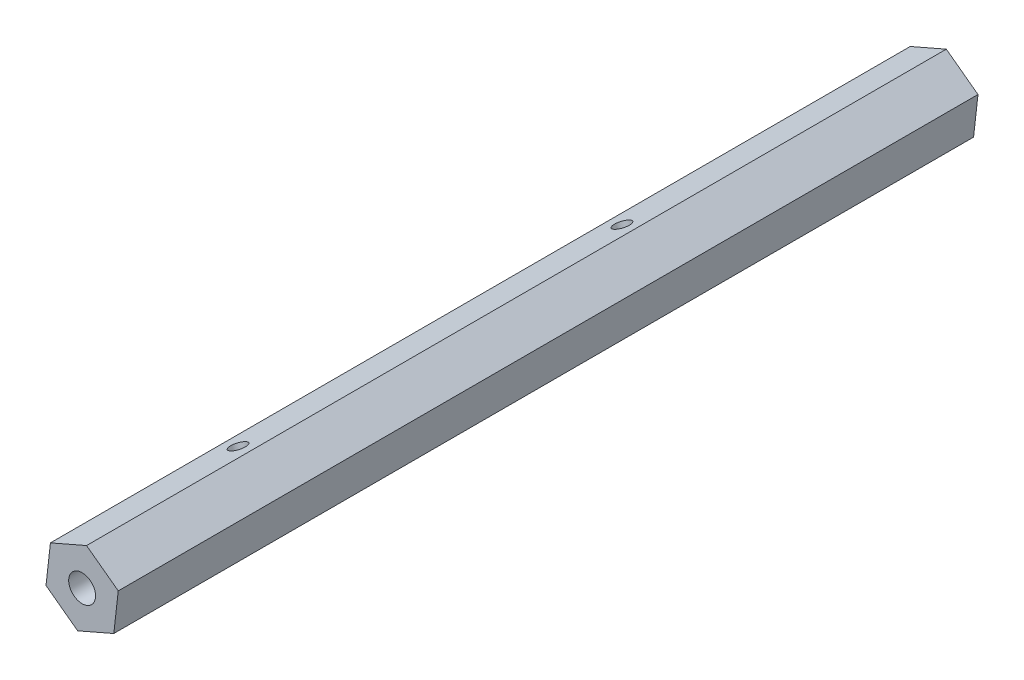
ISO-10303-21;
HEADER;
FILE_DESCRIPTION(('STEP AP214'),'2;1');
FILE_NAME('part.step','',(''),(''),'','','');
FILE_SCHEMA(('AUTOMOTIVE_DESIGN { 1 0 10303 214 1 1 1 1 }'));
ENDSEC;
DATA;
#1=APPLICATION_CONTEXT('core data for automotive mechanical design processes');
#2=APPLICATION_PROTOCOL_DEFINITION('international standard','automotive_design',2000,#1);
#3=PRODUCT_CONTEXT('',#1,'mechanical');
#4=PRODUCT('Part','Part','',(#3));
#5=PRODUCT_RELATED_PRODUCT_CATEGORY('part','',(#4));
#6=PRODUCT_DEFINITION_FORMATION('','',#4);
#7=PRODUCT_DEFINITION_CONTEXT('part definition',#1,'design');
#8=PRODUCT_DEFINITION('design','',#6,#7);
#9=PRODUCT_DEFINITION_SHAPE('','',#8);
#10=(LENGTH_UNIT() NAMED_UNIT(*) SI_UNIT(.MILLI.,.METRE.));
#11=(NAMED_UNIT(*) PLANE_ANGLE_UNIT() SI_UNIT($,.RADIAN.));
#12=(NAMED_UNIT(*) SI_UNIT($,.STERADIAN.) SOLID_ANGLE_UNIT());
#13=UNCERTAINTY_MEASURE_WITH_UNIT(LENGTH_MEASURE(1.E-05),#10,'distance_accuracy_value','');
#14=(GEOMETRIC_REPRESENTATION_CONTEXT(3) GLOBAL_UNCERTAINTY_ASSIGNED_CONTEXT((#13)) GLOBAL_UNIT_ASSIGNED_CONTEXT((#10,
#11,#12)) REPRESENTATION_CONTEXT('',''));
#15=CARTESIAN_POINT('',(0.,0.,0.));
#16=DIRECTION('',(0.,0.,1.));
#17=DIRECTION('',(1.,0.,0.));
#18=AXIS2_PLACEMENT_3D('',#15,#16,#17);
#19=CARTESIAN_POINT('',(0.,0.,160.));
#20=DIRECTION('',(0.,0.,1.));
#21=DIRECTION('',(1.,0.,0.));
#22=AXIS2_PLACEMENT_3D('',#19,#20,#21);
#23=PLANE('',#22);
#24=DIRECTION('',(0.916780772261359,0.399390805617589,0.));
#25=VECTOR('',#24,1.);
#26=CARTESIAN_POINT('',(-0.82494640722466,-7.285794174868,160.));
#27=LINE('',#26,#25);
#28=CARTESIAN_POINT('',(-0.82494640722466,-7.285794174868,160.));
#29=VERTEX_POINT('',#28);
#30=CARTESIAN_POINT('',(5.89720963856804,-4.35732163285126,160.));
#31=VERTEX_POINT('',#30);
#32=EDGE_CURVE('E135',#29,#31,#27,.T.);
#33=ORIENTED_EDGE('',*,*,#32,.T.);
#34=DIRECTION('',(0.112507802427915,0.993650841288247,0.));
#35=VECTOR('',#34,1.);
#36=CARTESIAN_POINT('',(5.89720963856804,-4.35732163285126,160.));
#37=LINE('',#36,#35);
#38=CARTESIAN_POINT('',(6.7221560457927,2.92847254201674,160.));
#39=VERTEX_POINT('',#38);
#40=EDGE_CURVE('E93',#31,#39,#37,.T.);
#41=ORIENTED_EDGE('',*,*,#40,.T.);
#42=DIRECTION('',(-0.804272969833444,0.594260035670658,0.));
#43=VECTOR('',#42,1.);
#44=CARTESIAN_POINT('',(6.7221560457927,2.92847254201674,160.));
#45=LINE('',#44,#43);
#46=CARTESIAN_POINT('',(0.824946407224662,7.285794174868,160.));
#47=VERTEX_POINT('',#46);
#48=EDGE_CURVE('E106',#39,#47,#45,.T.);
#49=ORIENTED_EDGE('',*,*,#48,.T.);
#50=DIRECTION('',(-0.916780772261359,-0.399390805617589,0.));
#51=VECTOR('',#50,1.);
#52=CARTESIAN_POINT('',(0.824946407224662,7.285794174868,160.));
#53=LINE('',#52,#51);
#54=CARTESIAN_POINT('',(-5.89720963856804,4.35732163285126,160.));
#55=VERTEX_POINT('',#54);
#56=EDGE_CURVE('E100',#47,#55,#53,.T.);
#57=ORIENTED_EDGE('',*,*,#56,.T.);
#58=DIRECTION('',(-0.112507802427915,-0.993650841288247,0.));
#59=VECTOR('',#58,1.);
#60=CARTESIAN_POINT('',(-5.89720963856804,4.35732163285126,160.));
#61=LINE('',#60,#59);
#62=CARTESIAN_POINT('',(-6.7221560457927,-2.92847254201674,160.));
#63=VERTEX_POINT('',#62);
#64=EDGE_CURVE('E104',#55,#63,#61,.T.);
#65=ORIENTED_EDGE('',*,*,#64,.T.);
#66=DIRECTION('',(0.804272969833444,-0.594260035670658,0.));
#67=VECTOR('',#66,1.);
#68=CARTESIAN_POINT('',(-6.7221560457927,-2.92847254201674,160.));
#69=LINE('',#68,#67);
#70=EDGE_CURVE('E56',#63,#29,#69,.T.);
#71=ORIENTED_EDGE('',*,*,#70,.T.);
#72=EDGE_LOOP('',(#33,#41,#49,#57,#65,#71));
#73=FACE_BOUND('',#72,.T.);
#74=CARTESIAN_POINT('',(0.,0.,160.));
#75=DIRECTION('',(0.,0.,1.));
#76=DIRECTION('',(1.,0.,0.));
#77=AXIS2_PLACEMENT_3D('',#74,#75,#76);
#78=CIRCLE('',#77,2.5);
#79=CARTESIAN_POINT('',(2.5,0.,160.));
#80=VERTEX_POINT('',#79);
#81=EDGE_CURVE('E128',#80,#80,#78,.T.);
#82=ORIENTED_EDGE('',*,*,#81,.F.);
#83=EDGE_LOOP('',(#82));
#84=FACE_BOUND('',#83,.T.);
#85=ADVANCED_FACE('F32',(#73,#84),#23,.T.);
#86=CARTESIAN_POINT('',(0.,0.,0.));
#87=DIRECTION('',(0.,0.,1.));
#88=DIRECTION('',(1.,0.,0.));
#89=AXIS2_PLACEMENT_3D('',#86,#87,#88);
#90=PLANE('',#89);
#91=DIRECTION('',(0.916780772261359,0.399390805617589,0.));
#92=VECTOR('',#91,1.);
#93=CARTESIAN_POINT('',(-0.82494640722466,-7.285794174868,0.));
#94=LINE('',#93,#92);
#95=CARTESIAN_POINT('',(-0.82494640722466,-7.285794174868,0.));
#96=VERTEX_POINT('',#95);
#97=CARTESIAN_POINT('',(5.89720963856804,-4.35732163285126,0.));
#98=VERTEX_POINT('',#97);
#99=EDGE_CURVE('E124',#96,#98,#94,.T.);
#100=ORIENTED_EDGE('',*,*,#99,.F.);
#101=DIRECTION('',(0.804272969833444,-0.594260035670658,0.));
#102=VECTOR('',#101,1.);
#103=CARTESIAN_POINT('',(-6.7221560457927,-2.92847254201674,0.));
#104=LINE('',#103,#102);
#105=CARTESIAN_POINT('',(-6.7221560457927,-2.92847254201674,0.));
#106=VERTEX_POINT('',#105);
#107=EDGE_CURVE('E85',#106,#96,#104,.T.);
#108=ORIENTED_EDGE('',*,*,#107,.F.);
#109=DIRECTION('',(-0.112507802427915,-0.993650841288247,0.));
#110=VECTOR('',#109,1.);
#111=CARTESIAN_POINT('',(-5.89720963856804,4.35732163285126,0.));
#112=LINE('',#111,#110);
#113=CARTESIAN_POINT('',(-5.89720963856804,4.35732163285126,0.));
#114=VERTEX_POINT('',#113);
#115=EDGE_CURVE('E79',#114,#106,#112,.T.);
#116=ORIENTED_EDGE('',*,*,#115,.F.);
#117=DIRECTION('',(-0.916780772261359,-0.399390805617589,0.));
#118=VECTOR('',#117,1.);
#119=CARTESIAN_POINT('',(0.824946407224662,7.285794174868,0.));
#120=LINE('',#119,#118);
#121=CARTESIAN_POINT('',(0.824946407224662,7.285794174868,0.));
#122=VERTEX_POINT('',#121);
#123=EDGE_CURVE('E114',#122,#114,#120,.T.);
#124=ORIENTED_EDGE('',*,*,#123,.F.);
#125=DIRECTION('',(-0.804272969833444,0.594260035670658,0.));
#126=VECTOR('',#125,1.);
#127=CARTESIAN_POINT('',(6.7221560457927,2.92847254201674,0.));
#128=LINE('',#127,#126);
#129=CARTESIAN_POINT('',(6.7221560457927,2.92847254201674,0.));
#130=VERTEX_POINT('',#129);
#131=EDGE_CURVE('E130',#130,#122,#128,.T.);
#132=ORIENTED_EDGE('',*,*,#131,.F.);
#133=DIRECTION('',(0.112507802427915,0.993650841288247,0.));
#134=VECTOR('',#133,1.);
#135=CARTESIAN_POINT('',(5.89720963856804,-4.35732163285126,0.));
#136=LINE('',#135,#134);
#137=EDGE_CURVE('E127',#98,#130,#136,.T.);
#138=ORIENTED_EDGE('',*,*,#137,.F.);
#139=EDGE_LOOP('',(#100,#108,#116,#124,#132,#138));
#140=FACE_BOUND('',#139,.T.);
#141=CARTESIAN_POINT('',(0.,0.,0.));
#142=DIRECTION('',(0.,0.,1.));
#143=DIRECTION('',(1.,0.,0.));
#144=AXIS2_PLACEMENT_3D('',#141,#142,#143);
#145=CIRCLE('',#144,2.5);
#146=CARTESIAN_POINT('',(2.5,0.,0.));
#147=VERTEX_POINT('',#146);
#148=EDGE_CURVE('E189',#147,#147,#145,.T.);
#149=ORIENTED_EDGE('',*,*,#148,.T.);
#150=EDGE_LOOP('',(#149));
#151=FACE_BOUND('',#150,.T.);
#152=ADVANCED_FACE('F203',(#140,#151),#90,.F.);
#153=CARTESIAN_POINT('',(-0.82494640722466,-7.285794174868,160.));
#154=DIRECTION('',(-0.399390805617589,0.916780772261359,0.));
#155=DIRECTION('',(-0.916780772261359,-0.399390805617589,0.));
#156=AXIS2_PLACEMENT_3D('',#153,#154,#155);
#157=PLANE('',#156);
#158=CARTESIAN_POINT('',(2.53613161567169,-5.82155790385963,128.44));
#159=DIRECTION('',(-0.399390805617589,0.916780772261359,0.));
#160=DIRECTION('',(-0.916780772261359,-0.399390805617589,0.));
#161=AXIS2_PLACEMENT_3D('',#158,#159,#160);
#162=CIRCLE('',#161,1.5);
#163=CARTESIAN_POINT('',(1.16096045727965,-6.42064411228601,128.44));
#164=VERTEX_POINT('',#163);
#165=EDGE_CURVE('E176',#164,#164,#162,.T.);
#166=ORIENTED_EDGE('',*,*,#165,.T.);
#167=EDGE_LOOP('',(#166));
#168=FACE_BOUND('',#167,.T.);
#169=CARTESIAN_POINT('',(2.53613161567169,-5.82155790385963,57.));
#170=DIRECTION('',(-0.399390805617589,0.916780772261359,0.));
#171=DIRECTION('',(-0.916780772261359,-0.399390805617589,0.));
#172=AXIS2_PLACEMENT_3D('',#169,#170,#171);
#173=CIRCLE('',#172,1.5);
#174=CARTESIAN_POINT('',(1.16096045727965,-6.42064411228601,57.));
#175=VERTEX_POINT('',#174);
#176=EDGE_CURVE('E186',#175,#175,#173,.T.);
#177=ORIENTED_EDGE('',*,*,#176,.T.);
#178=EDGE_LOOP('',(#177));
#179=FACE_BOUND('',#178,.T.);
#180=ORIENTED_EDGE('',*,*,#99,.T.);
#181=DIRECTION('',(0.,0.,-1.));
#182=VECTOR('',#181,1.);
#183=CARTESIAN_POINT('',(5.89720963856804,-4.35732163285126,160.));
#184=LINE('',#183,#182);
#185=EDGE_CURVE('E11',#31,#98,#184,.T.);
#186=ORIENTED_EDGE('',*,*,#185,.F.);
#187=ORIENTED_EDGE('',*,*,#32,.F.);
#188=DIRECTION('',(0.,0.,-1.));
#189=VECTOR('',#188,1.);
#190=CARTESIAN_POINT('',(-0.82494640722466,-7.285794174868,160.));
#191=LINE('',#190,#189);
#192=EDGE_CURVE('E120',#29,#96,#191,.T.);
#193=ORIENTED_EDGE('',*,*,#192,.T.);
#194=EDGE_LOOP('',(#180,#186,#187,#193));
#195=FACE_BOUND('',#194,.T.);
#196=ADVANCED_FACE('F34',(#168,#179,#195),#157,.F.);
#197=CARTESIAN_POINT('',(5.89720963856804,-4.35732163285126,160.));
#198=DIRECTION('',(-0.993650841288247,0.112507802427915,0.));
#199=DIRECTION('',(-0.112507802427915,-0.993650841288247,0.));
#200=AXIS2_PLACEMENT_3D('',#197,#198,#199);
#201=PLANE('',#200);
#202=ORIENTED_EDGE('',*,*,#137,.T.);
#203=DIRECTION('',(0.,0.,-1.));
#204=VECTOR('',#203,1.);
#205=CARTESIAN_POINT('',(6.7221560457927,2.92847254201674,160.));
#206=LINE('',#205,#204);
#207=EDGE_CURVE('E47',#39,#130,#206,.T.);
#208=ORIENTED_EDGE('',*,*,#207,.F.);
#209=ORIENTED_EDGE('',*,*,#40,.F.);
#210=ORIENTED_EDGE('',*,*,#185,.T.);
#211=EDGE_LOOP('',(#202,#208,#209,#210));
#212=FACE_BOUND('',#211,.T.);
#213=ADVANCED_FACE('F197',(#212),#201,.F.);
#214=CARTESIAN_POINT('',(6.7221560457927,2.92847254201674,160.));
#215=DIRECTION('',(-0.594260035670658,-0.804272969833444,0.));
#216=DIRECTION('',(0.804272969833444,-0.594260035670658,0.));
#217=AXIS2_PLACEMENT_3D('',#214,#215,#216);
#218=PLANE('',#217);
#219=ORIENTED_EDGE('',*,*,#131,.T.);
#220=DIRECTION('',(0.,0.,-1.));
#221=VECTOR('',#220,1.);
#222=CARTESIAN_POINT('',(0.824946407224662,7.285794174868,160.));
#223=LINE('',#222,#221);
#224=EDGE_CURVE('E115',#47,#122,#223,.T.);
#225=ORIENTED_EDGE('',*,*,#224,.F.);
#226=ORIENTED_EDGE('',*,*,#48,.F.);
#227=ORIENTED_EDGE('',*,*,#207,.T.);
#228=EDGE_LOOP('',(#219,#225,#226,#227));
#229=FACE_BOUND('',#228,.T.);
#230=ADVANCED_FACE('F200',(#229),#218,.F.);
#231=CARTESIAN_POINT('',(0.824946407224662,7.285794174868,160.));
#232=DIRECTION('',(0.399390805617589,-0.916780772261359,0.));
#233=DIRECTION('',(0.916780772261359,0.399390805617589,0.));
#234=AXIS2_PLACEMENT_3D('',#231,#232,#233);
#235=PLANE('',#234);
#236=CARTESIAN_POINT('',(-2.53613161567169,5.82155790385963,128.44));
#237=DIRECTION('',(-0.399390805617589,0.916780772261359,0.));
#238=DIRECTION('',(-0.916780772261359,-0.399390805617589,0.));
#239=AXIS2_PLACEMENT_3D('',#236,#237,#238);
#240=CIRCLE('',#239,1.5);
#241=CARTESIAN_POINT('',(-3.91130277406373,5.22247169543325,128.44));
#242=VERTEX_POINT('',#241);
#243=EDGE_CURVE('E173',#242,#242,#240,.T.);
#244=ORIENTED_EDGE('',*,*,#243,.F.);
#245=EDGE_LOOP('',(#244));
#246=FACE_BOUND('',#245,.T.);
#247=CARTESIAN_POINT('',(-2.53613161567169,5.82155790385963,57.));
#248=DIRECTION('',(-0.399390805617589,0.916780772261359,0.));
#249=DIRECTION('',(-0.916780772261359,-0.399390805617589,0.));
#250=AXIS2_PLACEMENT_3D('',#247,#248,#249);
#251=CIRCLE('',#250,1.5);
#252=CARTESIAN_POINT('',(-3.91130277406373,5.22247169543325,57.));
#253=VERTEX_POINT('',#252);
#254=EDGE_CURVE('E149',#253,#253,#251,.T.);
#255=ORIENTED_EDGE('',*,*,#254,.F.);
#256=EDGE_LOOP('',(#255));
#257=FACE_BOUND('',#256,.T.);
#258=ORIENTED_EDGE('',*,*,#123,.T.);
#259=DIRECTION('',(0.,0.,-1.));
#260=VECTOR('',#259,1.);
#261=CARTESIAN_POINT('',(-5.89720963856804,4.35732163285126,160.));
#262=LINE('',#261,#260);
#263=EDGE_CURVE('E111',#55,#114,#262,.T.);
#264=ORIENTED_EDGE('',*,*,#263,.F.);
#265=ORIENTED_EDGE('',*,*,#56,.F.);
#266=ORIENTED_EDGE('',*,*,#224,.T.);
#267=EDGE_LOOP('',(#258,#264,#265,#266));
#268=FACE_BOUND('',#267,.T.);
#269=ADVANCED_FACE('F112',(#246,#257,#268),#235,.F.);
#270=CARTESIAN_POINT('',(-5.89720963856804,4.35732163285126,160.));
#271=DIRECTION('',(0.993650841288247,-0.112507802427915,0.));
#272=DIRECTION('',(0.112507802427915,0.993650841288247,0.));
#273=AXIS2_PLACEMENT_3D('',#270,#271,#272);
#274=PLANE('',#273);
#275=ORIENTED_EDGE('',*,*,#115,.T.);
#276=DIRECTION('',(0.,0.,-1.));
#277=VECTOR('',#276,1.);
#278=CARTESIAN_POINT('',(-6.7221560457927,-2.92847254201674,160.));
#279=LINE('',#278,#277);
#280=EDGE_CURVE('E116',#63,#106,#279,.T.);
#281=ORIENTED_EDGE('',*,*,#280,.F.);
#282=ORIENTED_EDGE('',*,*,#64,.F.);
#283=ORIENTED_EDGE('',*,*,#263,.T.);
#284=EDGE_LOOP('',(#275,#281,#282,#283));
#285=FACE_BOUND('',#284,.T.);
#286=ADVANCED_FACE('F118',(#285),#274,.F.);
#287=CARTESIAN_POINT('',(-6.7221560457927,-2.92847254201674,160.));
#288=DIRECTION('',(0.594260035670658,0.804272969833444,0.));
#289=DIRECTION('',(-0.804272969833444,0.594260035670658,0.));
#290=AXIS2_PLACEMENT_3D('',#287,#288,#289);
#291=PLANE('',#290);
#292=ORIENTED_EDGE('',*,*,#107,.T.);
#293=ORIENTED_EDGE('',*,*,#192,.F.);
#294=ORIENTED_EDGE('',*,*,#70,.F.);
#295=ORIENTED_EDGE('',*,*,#280,.T.);
#296=EDGE_LOOP('',(#292,#293,#294,#295));
#297=FACE_BOUND('',#296,.T.);
#298=ADVANCED_FACE('F206',(#297),#291,.F.);
#299=CARTESIAN_POINT('',(0.,0.,160.));
#300=DIRECTION('',(0.,0.,-1.));
#301=DIRECTION('',(-1.,0.,0.));
#302=AXIS2_PLACEMENT_3D('',#299,#300,#301);
#303=CYLINDRICAL_SURFACE('',#302,2.5);
#304=CARTESIAN_POINT('',(-0.57638954715686,-2.4326477529491,128.44));
#305=CARTESIAN_POINT('',(-0.576395581822902,-2.43264401881237,128.51547897529));
#306=CARTESIAN_POINT('',(-0.569403150110111,-2.43433412807468,128.59093843408));
#307=CARTESIAN_POINT('',(-0.542132556356859,-2.44054929190407,128.739323903962));
#308=CARTESIAN_POINT('',(-0.521840529149695,-2.44507730484223,128.812247187385));
#309=CARTESIAN_POINT('',(-0.469784135663803,-2.45560435261248,128.953083641677));
#310=CARTESIAN_POINT('',(-0.438102630090655,-2.46159266477605,129.021028838035));
#311=CARTESIAN_POINT('',(-0.365018247693141,-2.47348553828873,129.151437453368));
#312=CARTESIAN_POINT('',(-0.32361247136544,-2.47939007410017,129.213899229695));
#313=CARTESIAN_POINT('',(-0.227045236393262,-2.4901980875089,129.339949016664));
#314=CARTESIAN_POINT('',(-0.17082089148849,-2.49489089763814,129.402740957124));
#315=CARTESIAN_POINT('',(-0.0498441671983197,-2.50023742399107,129.519764762742));
#316=CARTESIAN_POINT('',(0.0149145969306781,-2.50088809850584,129.573990151671));
#317=CARTESIAN_POINT('',(0.158683603954994,-2.49610264024284,129.67813380971));
#318=CARTESIAN_POINT('',(0.238477659694683,-2.49000155786441,129.72695446367));
#319=CARTESIAN_POINT('',(0.403878235161059,-2.46856466081536,129.810809722444));
#320=CARTESIAN_POINT('',(0.489479337698846,-2.45323735065145,129.845856974123));
#321=CARTESIAN_POINT('',(0.654877740645855,-2.41405338827928,129.897595922813));
#322=CARTESIAN_POINT('',(0.734449120080628,-2.39115051271235,129.915720360967));
#323=CARTESIAN_POINT('',(0.892574780637896,-2.3367235623609,129.937942802863));
#324=CARTESIAN_POINT('',(0.971129947682382,-2.30520761332716,129.942053978));
#325=CARTESIAN_POINT('',(1.11462723212544,-2.23898877574663,129.936386252658));
#326=CARTESIAN_POINT('',(1.18004951906869,-2.20516562761356,129.928266473831));
#327=CARTESIAN_POINT('',(1.30603796647122,-2.13296404015878,129.901520204352));
#328=CARTESIAN_POINT('',(1.36660376714713,-2.09458526386363,129.882892936093));
#329=CARTESIAN_POINT('',(1.48200249872774,-2.01460475176339,129.835834437296));
#330=CARTESIAN_POINT('',(1.53680012038517,-1.97298560471853,129.807346938861));
#331=CARTESIAN_POINT('',(1.6396433562824,-1.88838809427253,129.741615383774));
#332=CARTESIAN_POINT('',(1.68768721175921,-1.84540938037997,129.704369052941));
#333=CARTESIAN_POINT('',(1.78216268910409,-1.75461780644997,129.617160907196));
#334=CARTESIAN_POINT('',(1.82771628931296,-1.70684071441925,129.566211688264));
#335=CARTESIAN_POINT('',(1.91027078457971,-1.61392014276796,129.45559588214));
#336=CARTESIAN_POINT('',(1.94725992624249,-1.56878034516075,129.395917496525));
#337=CARTESIAN_POINT('',(2.01666568334709,-1.47873195023732,129.261346593836));
#338=CARTESIAN_POINT('',(2.04805562829731,-1.43445637856488,129.185492423461));
#339=CARTESIAN_POINT('',(2.10053394215099,-1.35645826114183,129.025293768363));
#340=CARTESIAN_POINT('',(2.12164130048488,-1.32271630410056,128.940965283874));
#341=CARTESIAN_POINT('',(2.14955783626513,-1.27669018748368,128.787606368105));
#342=CARTESIAN_POINT('',(2.15861344505284,-1.26116140120893,128.719959367703));
#343=CARTESIAN_POINT('',(2.17075972501381,-1.24014384550811,128.5826263897));
#344=CARTESIAN_POINT('',(2.17385733357879,-1.23464339964663,128.512942879515));
#345=CARTESIAN_POINT('',(2.17404400485859,-1.23431467031473,128.373448317564));
#346=CARTESIAN_POINT('',(2.17112474319764,-1.2395011722976,128.303637222785));
#347=CARTESIAN_POINT('',(2.15931482032539,-1.25995740439183,128.166012656251));
#348=CARTESIAN_POINT('',(2.15041943908395,-1.27523510452439,128.09820080776));
#349=CARTESIAN_POINT('',(2.12678104734754,-1.31427373251579,127.96628542052));
#350=CARTESIAN_POINT('',(2.11204534183344,-1.3380240592597,127.902177363468));
#351=CARTESIAN_POINT('',(2.07678957077972,-1.39211551225696,127.77852228427));
#352=CARTESIAN_POINT('',(2.05626732301365,-1.4224591239842,127.718976993634));
#353=CARTESIAN_POINT('',(2.00516831188243,-1.49383848978168,127.594759917488));
#354=CARTESIAN_POINT('',(1.97344591750725,-1.5358156297985,127.531099164903));
#355=CARTESIAN_POINT('',(1.90167680787897,-1.62384002888832,127.411714515151));
#356=CARTESIAN_POINT('',(1.8616221184163,-1.66989116242972,127.355998307831));
#357=CARTESIAN_POINT('',(1.76719689263714,-1.76983867634096,127.24677599265));
#358=CARTESIAN_POINT('',(1.71164211027909,-1.82397655797327,127.194499273394));
#359=CARTESIAN_POINT('',(1.58969134541333,-1.93117955543457,127.103097223163));
#360=CARTESIAN_POINT('',(1.5233025947636,-1.98424536051844,127.063963172159));
#361=CARTESIAN_POINT('',(1.38582925299775,-2.08232480096161,127.003131796569));
#362=CARTESIAN_POINT('',(1.315436792296,-2.12764335758025,126.980373772209));
#363=CARTESIAN_POINT('',(1.16803256667809,-2.21198565963132,126.949285397154));
#364=CARTESIAN_POINT('',(1.09102840114908,-2.25101648745361,126.940938709282));
#365=CARTESIAN_POINT('',(0.943804655735426,-2.3162125200141,126.939325391414));
#366=CARTESIAN_POINT('',(0.874049221117041,-2.34339922290543,126.944196665437));
#367=CARTESIAN_POINT('',(0.733869312328283,-2.39100654657625,126.964893824382));
#368=CARTESIAN_POINT('',(0.663444830714412,-2.4114270919878,126.980719831322));
#369=CARTESIAN_POINT('',(0.525164416216587,-2.4452393678214,127.022219571584));
#370=CARTESIAN_POINT('',(0.457285412375869,-2.45873838931308,127.047731596129));
#371=CARTESIAN_POINT('',(0.324620244057245,-2.47974554273226,127.107640594555));
#372=CARTESIAN_POINT('',(0.259834777004811,-2.48725232967385,127.14203956086));
#373=CARTESIAN_POINT('',(0.127938862068149,-2.49769278619842,127.222925196569));
#374=CARTESIAN_POINT('',(0.0613395369166302,-2.50004152429229,127.270318709017));
#375=CARTESIAN_POINT('',(-0.0648329177952999,-2.49995725709006,127.373753033718));
#376=CARTESIAN_POINT('',(-0.124398133021654,-2.49751891901282,127.429803425608));
#377=CARTESIAN_POINT('',(-0.241941281463492,-2.48904738081413,127.557285562178));
#378=CARTESIAN_POINT('',(-0.298760022661342,-2.48259751699635,127.629766486166));
#379=CARTESIAN_POINT('',(-0.398867456247678,-2.46849487686646,127.783484852767));
#380=CARTESIAN_POINT('',(-0.442163181724813,-2.46084272896472,127.864717713981));
#381=CARTESIAN_POINT('',(-0.509094944125183,-2.44783479131457,128.027064285137));
#382=CARTESIAN_POINT('',(-0.53409459289075,-2.44233866566487,128.107595235961));
#383=CARTESIAN_POINT('',(-0.567720849517202,-2.43475090031513,128.272097394704));
#384=CARTESIAN_POINT('',(-0.576382836079444,-2.43265190563634,128.356060765759));
#385=CARTESIAN_POINT('',(-0.57638954715686,-2.4326477529491,128.44));
#386=B_SPLINE_CURVE_WITH_KNOTS('',3,(#304,#305,#306,#307,#308,#309,#310,#311,#312,#313,#314,
#315,#316,#317,#318,#319,#320,#321,#322,#323,#324,#325,#326,#327,#328,#329,#330,#331,#332,#333,
#334,#335,#336,#337,#338,#339,#340,#341,#342,#343,#344,#345,#346,#347,#348,#349,#350,#351,#352,
#353,#354,#355,#356,#357,#358,#359,#360,#361,#362,#363,#364,#365,#366,#367,#368,#369,#370,#371,
#372,#373,#374,#375,#376,#377,#378,#379,#380,#381,#382,#383,#384,#385),.UNSPECIFIED.,.T.,.F.,(4,
2,2,2,2,2,2,2,2,2,2,2,2,2,2,2,2,2,2,2,2,2,2,2,2,2,2,2,2,2,2,2,2,2,2,2,2,2,2,2,4),(0.,
0.226085249493432,0.452406574330771,0.677113624991879,0.901887762215938,1.15414462390002,
1.40659128601844,1.68630157736224,1.96575443271222,2.21853330858498,2.47107452602767,
2.69230130543182,2.91354445887945,3.13607155036378,3.35865648368878,3.6078281005585,
3.85733966656907,4.13576671140273,4.41367760154767,4.62276298054684,4.83160475643977,
5.04073566011182,5.25003193304127,5.45906724365495,5.66818149154665,5.91499438482003,
6.16204457978455,6.44121828011591,6.7202063838485,6.97891479383339,7.23732973022727,
7.461293218494,7.68525920139649,7.90563970188758,8.12606965394586,8.37042963549487,
8.61506198741956,8.89071695766606,9.16622832484808,9.41820120134356,9.66962780912277),.UNSPECIFIED.);
#387=CARTESIAN_POINT('',(-0.57638954715686,-2.4326477529491,128.44));
#388=VERTEX_POINT('',#387);
#389=EDGE_CURVE('E36',#388,#388,#386,.T.);
#390=ORIENTED_EDGE('',*,*,#389,.F.);
#391=EDGE_LOOP('',(#390));
#392=FACE_BOUND('',#391,.T.);
#393=CARTESIAN_POINT('',(-2.17395276962722,1.23447533609633,128.44));
#394=CARTESIAN_POINT('',(-2.17395414454091,1.23446837401448,128.36452102471));
#395=CARTESIAN_POINT('',(-2.17043016046156,1.240739905469,128.28906156592));
#396=CARTESIAN_POINT('',(-2.15641100784935,1.26494273392182,128.140676096038));
#397=CARTESIAN_POINT('',(-2.14590856393659,1.28288619906108,128.067752812615));
#398=CARTESIAN_POINT('',(-2.11816855238802,1.32817613830592,127.926916358323));
#399=CARTESIAN_POINT('',(-2.10097955844385,1.35545463102706,127.858971161965));
#400=CARTESIAN_POINT('',(-2.05992023843281,1.41707361861243,127.728562546632));
#401=CARTESIAN_POINT('',(-2.03604791917823,1.45141621941457,127.666100770305));
#402=CARTESIAN_POINT('',(-1.97820293652787,1.52949311744589,127.540050983336));
#403=CARTESIAN_POINT('',(-1.94335220186442,1.57386231532345,127.477259042876));
#404=CARTESIAN_POINT('',(-1.86488550379669,1.66609533792582,127.360235237258));
#405=CARTESIAN_POINT('',(-1.8212629650816,1.71396176692245,127.306009848329));
#406=CARTESIAN_POINT('',(-1.71985558621848,1.81598613412783,127.20186619029));
#407=CARTESIAN_POINT('',(-1.66105004226595,1.87026525108844,127.15304553633));
#408=CARTESIAN_POINT('',(-1.53271815284276,1.97679138439279,127.069190277556));
#409=CARTESIAN_POINT('',(-1.46320172425181,2.02904022503547,127.034143025877));
#410=CARTESIAN_POINT('',(-1.32187500304611,2.1234794778801,126.982404077187));
#411=CARTESIAN_POINT('',(-1.25091701463849,2.16615394349516,126.964279639033));
#412=CARTESIAN_POINT('',(-1.1033802853962,2.24488723363166,126.942057197137));
#413=CARTESIAN_POINT('',(-1.02680689182095,2.28095224034527,126.937946022));
#414=CARTESIAN_POINT('',(-0.880596417017365,2.340943090904,126.943613747342));
#415=CARTESIAN_POINT('',(-0.811276593439242,2.36581964688777,126.951733526169));
#416=CARTESIAN_POINT('',(-0.672607967547884,2.40891454569602,126.978479795648));
#417=CARTESIAN_POINT('',(-0.603259163469543,2.42713239557826,126.997107063907));
#418=CARTESIAN_POINT('',(-0.466105292577577,2.45717511958225,127.044165562704));
#419=CARTESIAN_POINT('',(-0.39831152005861,2.46896227987205,127.072653061139));
#420=CARTESIAN_POINT('',(-0.266326551810821,2.48666646299656,127.138384616226));
#421=CARTESIAN_POINT('',(-0.202136297086288,2.49258195920018,127.175630947059));
#422=CARTESIAN_POINT('',(-0.0713135946865937,2.4999403729607,127.262839092804));
#423=CARTESIAN_POINT('',(-0.0053052500893228,2.50076466564542,127.313788311736));
#424=CARTESIAN_POINT('',(0.118958655092319,2.49794346133566,127.42440411786));
#425=CARTESIAN_POINT('',(0.177203515554147,2.49429186459561,127.484082503475));
#426=CARTESIAN_POINT('',(0.290410155414367,2.48379761668995,127.618653406164));
#427=CARTESIAN_POINT('',(0.344209229429358,2.4766342008826,127.694507576539));
#428=CARTESIAN_POINT('',(0.437064211012016,2.46194978255056,127.854706231637));
#429=CARTESIAN_POINT('',(0.476147264923597,2.45442946754687,127.939034716126));
#430=CARTESIAN_POINT('',(0.528862975117126,2.44353037219024,128.092393631895));
#431=CARTESIAN_POINT('',(0.546401457528848,2.43958716431131,128.160040632297));
#432=CARTESIAN_POINT('',(0.570064074244011,2.43416956939117,128.2973736103));
#433=CARTESIAN_POINT('',(0.576201483473265,2.43269231130623,128.367057120485));
#434=CARTESIAN_POINT('',(0.576569332750989,2.43260515598953,128.506551682436));
#435=CARTESIAN_POINT('',(0.570783276616098,2.43399923126272,128.576362777215));
#436=CARTESIAN_POINT('',(0.547760771878325,2.43928089627865,128.713987343749));
#437=CARTESIAN_POINT('',(0.530515272550501,2.44317045688428,128.78179919224));
#438=CARTESIAN_POINT('',(0.485829858267481,2.45244417187293,128.91371457948));
#439=CARTESIAN_POINT('',(0.458402681091392,2.4578264566658,128.977822636532));
#440=CARTESIAN_POINT('',(0.394782835417198,2.46884325821342,129.10147771573));
#441=CARTESIAN_POINT('',(0.358586860748228,2.47447786945011,129.161023006366));
#442=CARTESIAN_POINT('',(0.271518110680911,2.48566516411662,129.285240082512));
#443=CARTESIAN_POINT('',(0.219175806282604,2.49101995254951,129.348900835097));
#444=CARTESIAN_POINT('',(0.1058419724514,2.49840521091202,129.468285484849));
#445=CARTESIAN_POINT('',(0.0448421754866216,2.50043247967933,129.524001692169));
#446=CARTESIAN_POINT('',(-0.0926512715435697,2.49934582231032,129.63322400735));
#447=CARTESIAN_POINT('',(-0.170128215551244,2.49552911984413,129.685500726606));
#448=CARTESIAN_POINT('',(-0.331679084083972,2.47922609581936,129.776902776837));
#449=CARTESIAN_POINT('',(-0.415748588648595,2.46674553957014,129.816036827841));
#450=CARTESIAN_POINT('',(-0.581188677630685,2.4328623093299,129.876868203431));
#451=CARTESIAN_POINT('',(-0.662311235415428,2.41217413115717,129.899626227791));
#452=CARTESIAN_POINT('',(-0.824454186632991,2.36166380532424,129.930714602846));
#453=CARTESIAN_POINT('',(-0.90547459156906,2.3318520456763,129.939061290718));
#454=CARTESIAN_POINT('',(-1.05347368137686,2.26843577575038,129.940674608586));
#455=CARTESIAN_POINT('',(-1.12088434628834,2.23586677624022,129.935803334563));
#456=CARTESIAN_POINT('',(-1.2512064211259,2.16563130866751,129.915106175618));
#457=CARTESIAN_POINT('',(-1.31411778092829,2.12796478383044,129.899280168678));
#458=CARTESIAN_POINT('',(-1.43304413091709,2.04972626193055,129.857780428416));
#459=CARTESIAN_POINT('',(-1.4891534018926,2.00921043225575,129.832268403871));
#460=CARTESIAN_POINT('',(-1.59487862665504,1.92636404290342,129.772359405445));
#461=CARTESIAN_POINT('',(-1.64449312056995,1.8840330780555,129.73796043914));
#462=CARTESIAN_POINT('',(-1.74195643112419,1.79455437329717,129.657074803431));
#463=CARTESIAN_POINT('',(-1.78902883669964,1.74738260934232,129.609681290983));
#464=CARTESIAN_POINT('',(-1.87488728442055,1.65492817524666,129.506246966282));
#465=CARTESIAN_POINT('',(-1.91366403187427,1.60964766934785,129.450196574392));
#466=CARTESIAN_POINT('',(-1.98750408417467,1.51780102879228,129.322714437822));
#467=CARTESIAN_POINT('',(-2.02147288343173,1.47180004215492,129.250233513835));
#468=CARTESIAN_POINT('',(-2.07931596892172,1.38888707465964,129.096515147233));
#469=CARTESIAN_POINT('',(-2.10319550469462,1.35197037134837,129.015282286019));
#470=CARTESIAN_POINT('',(-2.13924848068047,1.29409766463361,128.852935714863));
#471=CARTESIAN_POINT('',(-2.15224773601134,1.27204751278828,128.772404764039));
#472=CARTESIAN_POINT('',(-2.16958976303862,1.24225567806304,128.607902605296));
#473=CARTESIAN_POINT('',(-2.17395124060271,1.23448307854139,128.523939234241));
#474=CARTESIAN_POINT('',(-2.17395276962722,1.23447533609633,128.44));
#475=B_SPLINE_CURVE_WITH_KNOTS('',3,(#393,#394,#395,#396,#397,#398,#399,#400,#401,#402,#403,
#404,#405,#406,#407,#408,#409,#410,#411,#412,#413,#414,#415,#416,#417,#418,#419,#420,#421,#422,
#423,#424,#425,#426,#427,#428,#429,#430,#431,#432,#433,#434,#435,#436,#437,#438,#439,#440,#441,
#442,#443,#444,#445,#446,#447,#448,#449,#450,#451,#452,#453,#454,#455,#456,#457,#458,#459,#460,
#461,#462,#463,#464,#465,#466,#467,#468,#469,#470,#471,#472,#473,#474),.UNSPECIFIED.,.T.,.F.,(4,
2,2,2,2,2,2,2,2,2,2,2,2,2,2,2,2,2,2,2,2,2,2,2,2,2,2,2,2,2,2,2,2,2,2,2,2,2,2,2,4),(0.,
0.226085249493432,0.452406574330771,0.677113624991884,0.901887762215937,1.15414462390002,
1.40659128601843,1.68630157736223,1.96575443271222,2.21853330858498,2.47107452602766,
2.69230130543181,2.91354445887945,3.13607155036375,3.35865648368878,3.6078281005585,
3.85733966656907,4.13576671140273,4.41367760154767,4.62276298054687,4.83160475643977,
5.04073566011182,5.25003193304126,5.45906724365495,5.66818149154665,5.91499438482006,
6.16204457978455,6.44121828011591,6.7202063838485,6.97891479383339,7.23732973022727,
7.461293218494,7.68525920139649,7.90563970188758,8.12606965394586,8.37042963549487,
8.61506198741956,8.89071695766606,9.16622832484809,9.41820120134357,9.66962780912278),.UNSPECIFIED.);
#476=CARTESIAN_POINT('',(-2.17395276962722,1.23447533609633,128.44));
#477=VERTEX_POINT('',#476);
#478=EDGE_CURVE('E168',#477,#477,#475,.T.);
#479=ORIENTED_EDGE('',*,*,#478,.F.);
#480=EDGE_LOOP('',(#479));
#481=FACE_BOUND('',#480,.T.);
#482=CARTESIAN_POINT('',(-0.57638954715686,-2.4326477529491,57.));
#483=CARTESIAN_POINT('',(-0.576395581822901,-2.43264401881237,57.0754789752896));
#484=CARTESIAN_POINT('',(-0.569403150110112,-2.43433412807468,57.1509384340798));
#485=CARTESIAN_POINT('',(-0.542132556356866,-2.44054929190406,57.2993239039622));
#486=CARTESIAN_POINT('',(-0.5218405291497,-2.44507730484223,57.3722471873851));
#487=CARTESIAN_POINT('',(-0.469784135663804,-2.45560435261248,57.5130836416773));
#488=CARTESIAN_POINT('',(-0.438102630090657,-2.46159266477605,57.5810288380353));
#489=CARTESIAN_POINT('',(-0.365018247693144,-2.47348553828872,57.7114374533679));
#490=CARTESIAN_POINT('',(-0.323612471365444,-2.47939007410017,57.7738992296951));
#491=CARTESIAN_POINT('',(-0.22704523639327,-2.4901980875089,57.8999490166641));
#492=CARTESIAN_POINT('',(-0.170820891488503,-2.49489089763814,57.9627409571239));
#493=CARTESIAN_POINT('',(-0.0498441671983297,-2.50023742399107,58.0797647627418));
#494=CARTESIAN_POINT('',(0.0149145969306762,-2.50088809850584,58.1339901516708));
#495=CARTESIAN_POINT('',(0.158683603954995,-2.49610264024284,58.2381338097097));
#496=CARTESIAN_POINT('',(0.238477659694678,-2.49000155786441,58.2869544636698));
#497=CARTESIAN_POINT('',(0.403878235161046,-2.46856466081537,58.3708097224444));
#498=CARTESIAN_POINT('',(0.48947933769883,-2.45323735065145,58.4058569741227));
#499=CARTESIAN_POINT('',(0.654877740645839,-2.41405338827928,58.4575959228127));
#500=CARTESIAN_POINT('',(0.734449120080615,-2.39115051271235,58.4757203609673));
#501=CARTESIAN_POINT('',(0.892574780637889,-2.33672356236091,58.4979428028631));
#502=CARTESIAN_POINT('',(0.971129947682379,-2.30520761332717,58.5020539780001));
#503=CARTESIAN_POINT('',(1.11462723212543,-2.23898877574663,58.4963862526575));
#504=CARTESIAN_POINT('',(1.18004951906869,-2.20516562761357,58.4882664738307));
#505=CARTESIAN_POINT('',(1.30603796647121,-2.13296404015878,58.4615202043519));
#506=CARTESIAN_POINT('',(1.36660376714713,-2.09458526386363,58.4428929360929));
#507=CARTESIAN_POINT('',(1.48200249872774,-2.01460475176339,58.3958344372962));
#508=CARTESIAN_POINT('',(1.53680012038516,-1.97298560471853,58.367346938861));
#509=CARTESIAN_POINT('',(1.6396433562824,-1.88838809427253,58.3016153837745));
#510=CARTESIAN_POINT('',(1.68768721175921,-1.84540938037997,58.264369052941));
#511=CARTESIAN_POINT('',(1.78216268910409,-1.75461780644997,58.1771609071956));
#512=CARTESIAN_POINT('',(1.82771628931296,-1.70684071441924,58.1262116882643));
#513=CARTESIAN_POINT('',(1.91027078457971,-1.61392014276796,58.0155958821398));
#514=CARTESIAN_POINT('',(1.94725992624249,-1.56878034516075,57.9559174965255));
#515=CARTESIAN_POINT('',(2.01666568334709,-1.47873195023732,57.8213465938364));
#516=CARTESIAN_POINT('',(2.04805562829732,-1.43445637856487,57.7454924234605));
#517=CARTESIAN_POINT('',(2.100533942151,-1.35645826114182,57.5852937683634));
#518=CARTESIAN_POINT('',(2.12164130048489,-1.32271630410055,57.5009652838744));
#519=CARTESIAN_POINT('',(2.14955783626513,-1.27669018748367,57.3476063681046));
#520=CARTESIAN_POINT('',(2.15861344505284,-1.26116140120893,57.2799593677034));
#521=CARTESIAN_POINT('',(2.17075972501381,-1.24014384550811,57.1426263897005));
#522=CARTESIAN_POINT('',(2.17385733357879,-1.23464339964663,57.0729428795154));
#523=CARTESIAN_POINT('',(2.17404400485859,-1.23431467031473,56.9334483175643));
#524=CARTESIAN_POINT('',(2.17112474319764,-1.2395011722976,56.8636372227848));
#525=CARTESIAN_POINT('',(2.15931482032539,-1.25995740439183,56.7260126562514));
#526=CARTESIAN_POINT('',(2.15041943908395,-1.27523510452439,56.6582008077597));
#527=CARTESIAN_POINT('',(2.12678104734753,-1.3142737325158,56.5262854205202));
#528=CARTESIAN_POINT('',(2.11204534183344,-1.3380240592597,56.4621773634678));
#529=CARTESIAN_POINT('',(2.07678957077972,-1.39211551225696,56.3385222842698));
#530=CARTESIAN_POINT('',(2.05626732301365,-1.42245912398419,56.278976993634));
#531=CARTESIAN_POINT('',(2.00516831188243,-1.49383848978168,56.1547599174877));
#532=CARTESIAN_POINT('',(1.97344591750725,-1.5358156297985,56.0910991649034));
#533=CARTESIAN_POINT('',(1.90167680787897,-1.62384002888832,55.9717145151505));
#534=CARTESIAN_POINT('',(1.86162211841629,-1.66989116242973,55.9159983078309));
#535=CARTESIAN_POINT('',(1.76719689263713,-1.76983867634097,55.8067759926496));
#536=CARTESIAN_POINT('',(1.71164211027908,-1.82397655797327,55.7544992733942));
#537=CARTESIAN_POINT('',(1.58969134541333,-1.93117955543457,55.6630972231633));
#538=CARTESIAN_POINT('',(1.5233025947636,-1.98424536051844,55.6239631721591));
#539=CARTESIAN_POINT('',(1.38582925299775,-2.0823248009616,55.5631317965686));
#540=CARTESIAN_POINT('',(1.315436792296,-2.12764335758025,55.5403737722089));
#541=CARTESIAN_POINT('',(1.16803256667808,-2.21198565963133,55.5092853971537));
#542=CARTESIAN_POINT('',(1.09102840114908,-2.25101648745361,55.5009387092824));
#543=CARTESIAN_POINT('',(0.943804655735414,-2.31621252001411,55.4993253914141));
#544=CARTESIAN_POINT('',(0.874049221117029,-2.34339922290543,55.504196665437));
#545=CARTESIAN_POINT('',(0.733869312328274,-2.39100654657625,55.5248938243816));
#546=CARTESIAN_POINT('',(0.663444830714405,-2.4114270919878,55.5407198313216));
#547=CARTESIAN_POINT('',(0.525164416216582,-2.4452393678214,55.5822195715838));
#548=CARTESIAN_POINT('',(0.457285412375864,-2.45873838931308,55.6077315961292));
#549=CARTESIAN_POINT('',(0.324620244057239,-2.47974554273226,55.6676405945548));
#550=CARTESIAN_POINT('',(0.259834777004804,-2.48725232967386,55.7020395608596));
#551=CARTESIAN_POINT('',(0.127938862068139,-2.49769278619842,55.7829251965688));
#552=CARTESIAN_POINT('',(0.0613395369166172,-2.50004152429229,55.8303187090169));
#553=CARTESIAN_POINT('',(-0.064832917795309,-2.49995725709006,55.9337530337177));
#554=CARTESIAN_POINT('',(-0.124398133021658,-2.49751891901282,55.9898034256079));
#555=CARTESIAN_POINT('',(-0.241941281463489,-2.48904738081413,56.1172855621777));
#556=CARTESIAN_POINT('',(-0.29876002266134,-2.48259751699635,56.1897664861655));
#557=CARTESIAN_POINT('',(-0.398867456247675,-2.46849487686647,56.3434848527666));
#558=CARTESIAN_POINT('',(-0.442163181724809,-2.46084272896472,56.4247177139814));
#559=CARTESIAN_POINT('',(-0.50909494412518,-2.44783479131457,56.5870642851372));
#560=CARTESIAN_POINT('',(-0.53409459289075,-2.44233866566487,56.6675952359613));
#561=CARTESIAN_POINT('',(-0.567720849517204,-2.43475090031512,56.8320973947037));
#562=CARTESIAN_POINT('',(-0.576382836079445,-2.43265190563634,56.9160607657587));
#563=CARTESIAN_POINT('',(-0.57638954715686,-2.4326477529491,57.));
#564=B_SPLINE_CURVE_WITH_KNOTS('',3,(#482,#483,#484,#485,#486,#487,#488,#489,#490,#491,#492,
#493,#494,#495,#496,#497,#498,#499,#500,#501,#502,#503,#504,#505,#506,#507,#508,#509,#510,#511,
#512,#513,#514,#515,#516,#517,#518,#519,#520,#521,#522,#523,#524,#525,#526,#527,#528,#529,#530,
#531,#532,#533,#534,#535,#536,#537,#538,#539,#540,#541,#542,#543,#544,#545,#546,#547,#548,#549,
#550,#551,#552,#553,#554,#555,#556,#557,#558,#559,#560,#561,#562,#563),.UNSPECIFIED.,.T.,.F.,(4,
2,2,2,2,2,2,2,2,2,2,2,2,2,2,2,2,2,2,2,2,2,2,2,2,2,2,2,2,2,2,2,2,2,2,2,2,2,2,2,4),(0.,
0.226085249493397,0.452406574330771,0.677113624991864,0.901887762215929,1.15414462390001,
1.40659128601843,1.68630157736222,1.9657544327122,2.21853330858497,2.47107452602767,
2.69230130543182,2.91354445887945,3.13607155036377,3.35865648368879,3.60782810055849,
3.85733966656909,4.13576671140277,4.41367760154768,4.62276298054684,4.83160475643978,
5.04073566011182,5.25003193304129,5.45906724365495,5.66818149154663,5.91499438482004,
6.16204457978456,6.44121828011591,6.7202063838485,6.9789147938334,7.23732973022728,
7.46129321849401,7.6852592013965,7.90563970188758,8.12606965394586,8.37042963549489,
8.61506198741957,8.89071695766605,9.16622832484808,9.41820120134356,9.66962780912278),.UNSPECIFIED.);
#565=CARTESIAN_POINT('',(-0.57638954715686,-2.4326477529491,57.));
#566=VERTEX_POINT('',#565);
#567=EDGE_CURVE('E148',#566,#566,#564,.T.);
#568=ORIENTED_EDGE('',*,*,#567,.F.);
#569=EDGE_LOOP('',(#568));
#570=FACE_BOUND('',#569,.T.);
#571=CARTESIAN_POINT('',(-2.17395276962722,1.23447533609633,57.));
#572=CARTESIAN_POINT('',(-2.17395414454091,1.23446837401448,56.9245210247104));
#573=CARTESIAN_POINT('',(-2.17043016046156,1.240739905469,56.8490615659202));
#574=CARTESIAN_POINT('',(-2.15641100784935,1.26494273392182,56.7006760960378));
#575=CARTESIAN_POINT('',(-2.14590856393659,1.28288619906108,56.6277528126149));
#576=CARTESIAN_POINT('',(-2.11816855238802,1.32817613830591,56.4869163583227));
#577=CARTESIAN_POINT('',(-2.10097955844385,1.35545463102705,56.4189711619647));
#578=CARTESIAN_POINT('',(-2.05992023843282,1.41707361861243,56.2885625466321));
#579=CARTESIAN_POINT('',(-2.03604791917823,1.45141621941457,56.2261007703049));
#580=CARTESIAN_POINT('',(-1.97820293652787,1.52949311744589,56.1000509833359));
#581=CARTESIAN_POINT('',(-1.94335220186443,1.57386231532344,56.0372590428761));
#582=CARTESIAN_POINT('',(-1.86488550379669,1.66609533792582,55.9202352372582));
#583=CARTESIAN_POINT('',(-1.82126296508159,1.71396176692246,55.8660098483292));
#584=CARTESIAN_POINT('',(-1.71985558621847,1.81598613412783,55.7618661902903));
#585=CARTESIAN_POINT('',(-1.66105004226595,1.87026525108845,55.7130455363302));
#586=CARTESIAN_POINT('',(-1.53271815284277,1.97679138439278,55.6291902775556));
#587=CARTESIAN_POINT('',(-1.46320172425182,2.02904022503546,55.5941430258773));
#588=CARTESIAN_POINT('',(-1.32187500304613,2.12347947788009,55.5424040771874));
#589=CARTESIAN_POINT('',(-1.25091701463851,2.16615394349516,55.5242796390327));
#590=CARTESIAN_POINT('',(-1.10338028539621,2.24488723363166,55.5020571971369));
#591=CARTESIAN_POINT('',(-1.02680689182095,2.28095224034527,55.4979460219999));
#592=CARTESIAN_POINT('',(-0.880596417017367,2.340943090904,55.5036137473425));
#593=CARTESIAN_POINT('',(-0.811276593439244,2.36581964688777,55.5117335261693));
#594=CARTESIAN_POINT('',(-0.672607967547884,2.40891454569602,55.5384797956481));
#595=CARTESIAN_POINT('',(-0.603259163469541,2.42713239557826,55.5571070639072));
#596=CARTESIAN_POINT('',(-0.466105292577572,2.45717511958225,55.6041655627038));
#597=CARTESIAN_POINT('',(-0.398311520058604,2.46896227987205,55.632653061139));
#598=CARTESIAN_POINT('',(-0.266326551810817,2.48666646299656,55.6983846162255));
#599=CARTESIAN_POINT('',(-0.202136297086288,2.49258195920018,55.735630947059));
#600=CARTESIAN_POINT('',(-0.0713135946865963,2.4999403729607,55.8228390928045));
#601=CARTESIAN_POINT('',(-0.00530525008932461,2.50076466564542,55.8737883117357));
#602=CARTESIAN_POINT('',(0.118958655092317,2.49794346133566,55.9844041178602));
#603=CARTESIAN_POINT('',(0.177203515554144,2.49429186459561,56.0440825034745));
#604=CARTESIAN_POINT('',(0.290410155414371,2.48379761668995,56.1786534061636));
#605=CARTESIAN_POINT('',(0.344209229429369,2.4766342008826,56.2545075765395));
#606=CARTESIAN_POINT('',(0.437064211012028,2.46194978255055,56.4147062316366));
#607=CARTESIAN_POINT('',(0.476147264923606,2.45442946754687,56.4990347161256));
#608=CARTESIAN_POINT('',(0.528862975117127,2.44353037219024,56.6523936318954));
#609=CARTESIAN_POINT('',(0.546401457528846,2.43958716431131,56.7200406322967));
#610=CARTESIAN_POINT('',(0.57006407424401,2.43416956939117,56.8573736102995));
#611=CARTESIAN_POINT('',(0.576201483473266,2.43269231130623,56.9270571204846));
#612=CARTESIAN_POINT('',(0.576569332750991,2.43260515598953,57.0665516824357));
#613=CARTESIAN_POINT('',(0.5707832766161,2.43399923126272,57.1363627772152));
#614=CARTESIAN_POINT('',(0.547760771878323,2.43928089627865,57.2739873437486));
#615=CARTESIAN_POINT('',(0.530515272550495,2.44317045688428,57.3417991922403));
#616=CARTESIAN_POINT('',(0.485829858267472,2.45244417187293,57.4737145794798));
#617=CARTESIAN_POINT('',(0.458402681091386,2.4578264566658,57.5378226365322));
#618=CARTESIAN_POINT('',(0.394782835417198,2.46884325821341,57.6614777157302));
#619=CARTESIAN_POINT('',(0.358586860748232,2.47447786945011,57.721023006366));
#620=CARTESIAN_POINT('',(0.27151811068092,2.48566516411662,57.8452400825123));
#621=CARTESIAN_POINT('',(0.219175806282612,2.49101995254951,57.9089008350966));
#622=CARTESIAN_POINT('',(0.105841972451401,2.49840521091203,58.0282854848495));
#623=CARTESIAN_POINT('',(0.0448421754866167,2.50043247967933,58.0840016921691));
#624=CARTESIAN_POINT('',(-0.0926512715435785,2.49934582231032,58.1932240073504));
#625=CARTESIAN_POINT('',(-0.170128215551249,2.49552911984413,58.2455007266058));
#626=CARTESIAN_POINT('',(-0.331679084083971,2.47922609581936,58.3369027768367));
#627=CARTESIAN_POINT('',(-0.415748588648592,2.46674553957014,58.3760368278409));
#628=CARTESIAN_POINT('',(-0.581188677630682,2.4328623093299,58.4368682034314));
#629=CARTESIAN_POINT('',(-0.662311235415427,2.41217413115717,58.4596262277911));
#630=CARTESIAN_POINT('',(-0.824454186632995,2.36166380532424,58.4907146028463));
#631=CARTESIAN_POINT('',(-0.905474591569066,2.3318520456763,58.4990612907176));
#632=CARTESIAN_POINT('',(-1.05347368137687,2.26843577575038,58.5006746085859));
#633=CARTESIAN_POINT('',(-1.12088434628835,2.23586677624021,58.495803334563));
#634=CARTESIAN_POINT('',(-1.25120642112591,2.16563130866751,58.4751061756184));
#635=CARTESIAN_POINT('',(-1.31411778092829,2.12796478383043,58.4592801686784));
#636=CARTESIAN_POINT('',(-1.4330441309171,2.04972626193055,58.4177804284162));
#637=CARTESIAN_POINT('',(-1.4891534018926,2.00921043225574,58.3922684038708));
#638=CARTESIAN_POINT('',(-1.59487862665505,1.92636404290342,58.3323594054452));
#639=CARTESIAN_POINT('',(-1.64449312056995,1.88403307805549,58.2979604391404));
#640=CARTESIAN_POINT('',(-1.74195643112419,1.79455437329716,58.2170748034312));
#641=CARTESIAN_POINT('',(-1.78902883669965,1.74738260934231,58.1696812909831));
#642=CARTESIAN_POINT('',(-1.87488728442056,1.65492817524665,58.0662469662823));
#643=CARTESIAN_POINT('',(-1.91366403187427,1.60964766934785,58.0101965743921));
#644=CARTESIAN_POINT('',(-1.98750408417467,1.51780102879228,57.8827144378223));
#645=CARTESIAN_POINT('',(-2.02147288343173,1.47180004215493,57.8102335138345));
#646=CARTESIAN_POINT('',(-2.07931596892172,1.38888707465964,57.6565151472335));
#647=CARTESIAN_POINT('',(-2.10319550469462,1.35197037134838,57.5752822860186));
#648=CARTESIAN_POINT('',(-2.13924848068047,1.29409766463361,57.4129357148628));
#649=CARTESIAN_POINT('',(-2.15224773601134,1.27204751278828,57.3324047640387));
#650=CARTESIAN_POINT('',(-2.16958976303862,1.24225567806304,57.1679026052963));
#651=CARTESIAN_POINT('',(-2.17395124060271,1.23448307854139,57.0839392342413));
#652=CARTESIAN_POINT('',(-2.17395276962722,1.23447533609633,57.));
#653=B_SPLINE_CURVE_WITH_KNOTS('',3,(#571,#572,#573,#574,#575,#576,#577,#578,#579,#580,#581,
#582,#583,#584,#585,#586,#587,#588,#589,#590,#591,#592,#593,#594,#595,#596,#597,#598,#599,#600,
#601,#602,#603,#604,#605,#606,#607,#608,#609,#610,#611,#612,#613,#614,#615,#616,#617,#618,#619,
#620,#621,#622,#623,#624,#625,#626,#627,#628,#629,#630,#631,#632,#633,#634,#635,#636,#637,#638,
#639,#640,#641,#642,#643,#644,#645,#646,#647,#648,#649,#650,#651,#652),.UNSPECIFIED.,.T.,.F.,(4,
2,2,2,2,2,2,2,2,2,2,2,2,2,2,2,2,2,2,2,2,2,2,2,2,2,2,2,2,2,2,2,2,2,2,2,2,2,2,2,4),(0.,
0.22608524949339,0.45240657433077,0.67711362499188,0.901887762215939,1.15414462390002,
1.40659128601844,1.68630157736223,1.9657544327122,2.21853330858497,2.47107452602767,
2.69230130543182,2.91354445887945,3.13607155036376,3.35865648368879,3.60782810055849,
3.85733966656908,4.13576671140277,4.41367760154768,4.62276298054685,4.83160475643978,
5.04073566011183,5.25003193304129,5.45906724365497,5.66818149154663,5.91499438482004,
6.16204457978457,6.44121828011591,6.7202063838485,6.9789147938334,7.23732973022728,
7.46129321849401,7.6852592013965,7.90563970188758,8.12606965394586,8.37042963549489,
8.61506198741957,8.89071695766605,9.16622832484808,9.41820120134356,9.66962780912278),.UNSPECIFIED.);
#654=CARTESIAN_POINT('',(-2.17395276962722,1.23447533609633,57.));
#655=VERTEX_POINT('',#654);
#656=EDGE_CURVE('E141',#655,#655,#653,.T.);
#657=ORIENTED_EDGE('',*,*,#656,.F.);
#658=EDGE_LOOP('',(#657));
#659=FACE_BOUND('',#658,.T.);
#660=ORIENTED_EDGE('',*,*,#81,.T.);
#661=EDGE_LOOP('',(#660));
#662=FACE_BOUND('',#661,.T.);
#663=ORIENTED_EDGE('',*,*,#148,.F.);
#664=EDGE_LOOP('',(#663));
#665=FACE_BOUND('',#664,.T.);
#666=ADVANCED_FACE('F153',(#392,#481,#570,#659,#662,#665),#303,.F.);
#667=CARTESIAN_POINT('',(3.73999268708421,-8.58495823061054,57.));
#668=DIRECTION('',(-0.399390805617589,0.916780772261359,0.));
#669=DIRECTION('',(-0.916780772261359,-0.399390805617589,0.));
#670=AXIS2_PLACEMENT_3D('',#667,#668,#669);
#671=CYLINDRICAL_SURFACE('',#670,1.5);
#672=ORIENTED_EDGE('',*,*,#656,.T.);
#673=EDGE_LOOP('',(#672));
#674=FACE_BOUND('',#673,.T.);
#675=ORIENTED_EDGE('',*,*,#254,.T.);
#676=EDGE_LOOP('',(#675));
#677=FACE_BOUND('',#676,.T.);
#678=ADVANCED_FACE('F156',(#674,#677),#671,.F.);
#679=ORIENTED_EDGE('',*,*,#567,.T.);
#680=EDGE_LOOP('',(#679));
#681=FACE_BOUND('',#680,.T.);
#682=ORIENTED_EDGE('',*,*,#176,.F.);
#683=EDGE_LOOP('',(#682));
#684=FACE_BOUND('',#683,.T.);
#685=ADVANCED_FACE('F159',(#681,#684),#671,.F.);
#686=CARTESIAN_POINT('',(3.73999268708421,-8.58495823061054,128.44));
#687=DIRECTION('',(-0.399390805617589,0.916780772261359,0.));
#688=DIRECTION('',(-0.916780772261359,-0.399390805617589,0.));
#689=AXIS2_PLACEMENT_3D('',#686,#687,#688);
#690=CYLINDRICAL_SURFACE('',#689,1.5);
#691=ORIENTED_EDGE('',*,*,#478,.T.);
#692=EDGE_LOOP('',(#691));
#693=FACE_BOUND('',#692,.T.);
#694=ORIENTED_EDGE('',*,*,#243,.T.);
#695=EDGE_LOOP('',(#694));
#696=FACE_BOUND('',#695,.T.);
#697=ADVANCED_FACE('F161',(#693,#696),#690,.F.);
#698=ORIENTED_EDGE('',*,*,#389,.T.);
#699=EDGE_LOOP('',(#698));
#700=FACE_BOUND('',#699,.T.);
#701=ORIENTED_EDGE('',*,*,#165,.F.);
#702=EDGE_LOOP('',(#701));
#703=FACE_BOUND('',#702,.T.);
#704=ADVANCED_FACE('F165',(#700,#703),#690,.F.);
#705=CLOSED_SHELL('',(#85,#152,#196,#213,#230,#269,#286,#298,#666,#678,#685,#697,#704));
#706=MANIFOLD_SOLID_BREP('B2',#705);
#707=ADVANCED_BREP_SHAPE_REPRESENTATION('',(#18,#706),#14);
#708=SHAPE_DEFINITION_REPRESENTATION(#9,#707);
ENDSEC;
END-ISO-10303-21;
